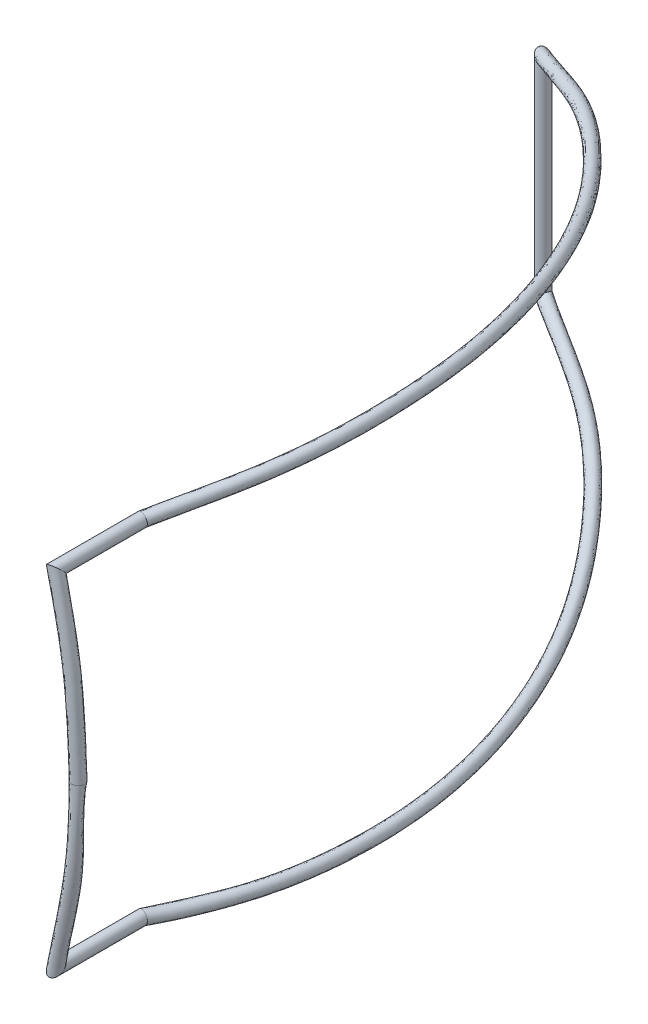
ISO-10303-21;
HEADER;
FILE_DESCRIPTION(('STEP AP214'),'2;1');
FILE_NAME('part.step','',(''),(''),'','','');
FILE_SCHEMA(('AUTOMOTIVE_DESIGN { 1 0 10303 214 1 1 1 1 }'));
ENDSEC;
DATA;
#1=APPLICATION_CONTEXT('core data for automotive mechanical design processes');
#2=APPLICATION_PROTOCOL_DEFINITION('international standard','automotive_design',2000,#1);
#3=PRODUCT_CONTEXT('',#1,'mechanical');
#4=PRODUCT('Part','Part','',(#3));
#5=PRODUCT_RELATED_PRODUCT_CATEGORY('part','',(#4));
#6=PRODUCT_DEFINITION_FORMATION('','',#4);
#7=PRODUCT_DEFINITION_CONTEXT('part definition',#1,'design');
#8=PRODUCT_DEFINITION('design','',#6,#7);
#9=PRODUCT_DEFINITION_SHAPE('','',#8);
#10=(LENGTH_UNIT() NAMED_UNIT(*) SI_UNIT(.MILLI.,.METRE.));
#11=(NAMED_UNIT(*) PLANE_ANGLE_UNIT() SI_UNIT($,.RADIAN.));
#12=(NAMED_UNIT(*) SI_UNIT($,.STERADIAN.) SOLID_ANGLE_UNIT());
#13=UNCERTAINTY_MEASURE_WITH_UNIT(LENGTH_MEASURE(1.E-05),#10,'distance_accuracy_value','');
#14=(GEOMETRIC_REPRESENTATION_CONTEXT(3) GLOBAL_UNCERTAINTY_ASSIGNED_CONTEXT((#13)) GLOBAL_UNIT_ASSIGNED_CONTEXT((#10,
#11,#12)) REPRESENTATION_CONTEXT('',''));
#15=CARTESIAN_POINT('',(0.,0.,0.));
#16=DIRECTION('',(0.,0.,1.));
#17=DIRECTION('',(1.,0.,0.));
#18=AXIS2_PLACEMENT_3D('',#15,#16,#17);
#19=CARTESIAN_POINT('',(1840.,0.,16.85));
#20=CARTESIAN_POINT('',(1836.8396931025,88.9620389803422,16.8500000000001));
#21=CARTESIAN_POINT('',(1831.18867065611,248.037247641803,16.8500000000004));
#22=CARTESIAN_POINT('',(1793.69727131029,406.964526359535,16.8499999999992));
#23=CARTESIAN_POINT('',(1777.1727552274,477.012495200543,16.8499999999987));
#24=CARTESIAN_POINT('',(1873.7,0.,16.85));
#25=CARTESIAN_POINT('',(1870.48241577035,90.5585240920456,16.8500000000001));
#26=CARTESIAN_POINT('',(1864.72897431842,252.488447024672,16.8500000000004));
#27=CARTESIAN_POINT('',(1826.60337396209,414.18275217626,16.8499999999992));
#28=CARTESIAN_POINT('',(1809.79933070814,485.450301337177,16.8499999999987));
#29=CARTESIAN_POINT('',(1873.7,0.,-16.85));
#30=CARTESIAN_POINT('',(1870.5591471221,86.8884708383124,-16.8500000000001));
#31=CARTESIAN_POINT('',(1864.94291088636,242.255881334985,-16.8500000000004));
#32=CARTESIAN_POINT('',(1832.52533890872,388.406938587006,-16.8499999999992));
#33=CARTESIAN_POINT('',(1818.23713684478,452.823725856438,-16.8499999999987));
#34=CARTESIAN_POINT('',(1840.,0.,-16.85));
#35=CARTESIAN_POINT('',(1836.91642445425,85.291985726609,-16.8500000000001));
#36=CARTESIAN_POINT('',(1831.40260722405,237.804681952116,-16.8500000000004));
#37=CARTESIAN_POINT('',(1799.61923625692,381.188712770281,-16.8499999999992));
#38=CARTESIAN_POINT('',(1785.61056136403,444.385919719803,-16.8499999999987));
#39=CARTESIAN_POINT('',(1806.3,0.,-16.85));
#40=CARTESIAN_POINT('',(1803.2737017864,83.6955006149055,-16.8500000000001));
#41=CARTESIAN_POINT('',(1797.86230356175,233.353482569248,-16.8500000000004));
#42=CARTESIAN_POINT('',(1766.71313360513,373.970486953556,-16.8499999999992));
#43=CARTESIAN_POINT('',(1752.98398588329,435.948113583169,-16.8499999999987));
#44=CARTESIAN_POINT('',(1806.3,0.,16.85));
#45=CARTESIAN_POINT('',(1803.19697043465,87.3655538686387,16.8500000000001));
#46=CARTESIAN_POINT('',(1797.6483669938,243.586048258934,16.8500000000004));
#47=CARTESIAN_POINT('',(1760.7911686585,399.746300542811,16.8499999999992));
#48=CARTESIAN_POINT('',(1744.54617974666,468.574689063908,16.8499999999987));
#49=CARTESIAN_POINT('',(1840.,0.,16.85));
#50=CARTESIAN_POINT('',(1836.8396931025,88.9620389803422,16.8500000000001));
#51=CARTESIAN_POINT('',(1831.18867065611,248.037247641803,16.8500000000004));
#52=CARTESIAN_POINT('',(1793.69727131029,406.964526359535,16.8499999999992));
#53=CARTESIAN_POINT('',(1777.1727552274,477.012495200543,16.8499999999987));
#54=(BOUNDED_SURFACE() B_SPLINE_SURFACE(3,3,((#19,#20,#21,#22,#23),(#24,#25,#26,#27,#28),(#29,
#30,#31,#32,#33),(#34,#35,#36,#37,#38),(#39,#40,#41,#42,#43),(#44,#45,#46,#47,#48),(#49,#50,#51,
#52,#53)),.UNSPECIFIED.,.T.,.F.,.F.) B_SPLINE_SURFACE_WITH_KNOTS((4,3,4),(4,1,4),(0.,0.5,1.),
(0.,0.559245150321749,1.),
.UNSPECIFIED.) GEOMETRIC_REPRESENTATION_ITEM() RATIONAL_B_SPLINE_SURFACE(((1.,1.,1.,1.,1.),
(0.333333333333333,0.333333333333333,0.333333333333333,0.333333333333333,0.333333333333333),
(0.333333333333333,0.333333333333333,0.333333333333333,0.333333333333333,0.333333333333333),(1.,
1.,1.,1.,1.),(0.333333333333333,0.333333333333333,0.333333333333333,0.333333333333333,
0.333333333333333),(0.333333333333333,0.333333333333333,0.333333333333333,0.333333333333333,
0.333333333333333),(1.,1.,1.,1.,1.))) REPRESENTATION_ITEM('') SURFACE());
#55=CARTESIAN_POINT('',(1840.,0.,0.));
#56=DIRECTION('',(0.,-1.,0.));
#57=DIRECTION('',(0.,0.,-1.));
#58=AXIS2_PLACEMENT_3D('',#55,#56,#57);
#59=CIRCLE('',#58,16.85);
#60=CARTESIAN_POINT('',(1840.,0.,-16.85));
#61=VERTEX_POINT('',#60);
#62=EDGE_CURVE('E220',#61,#61,#59,.T.);
#63=CARTESIAN_POINT('',(1777.1727552274,477.012495200543,16.8499999999982));
#64=CARTESIAN_POINT('',(1744.54617974666,468.574689063908,16.8499999999982));
#65=CARTESIAN_POINT('',(1752.98398588329,435.948113583169,-16.849999999999));
#66=CARTESIAN_POINT('',(1785.61056136403,444.385919719803,-16.849999999999));
#67=CARTESIAN_POINT('',(1818.23713684478,452.823725856438,-16.8499999999991));
#68=CARTESIAN_POINT('',(1809.79933070814,485.450301337177,16.8499999999983));
#69=CARTESIAN_POINT('',(1777.1727552274,477.012495200543,16.8499999999982));
#70=(BOUNDED_CURVE() B_SPLINE_CURVE(3,(#63,#64,#65,#66,#67,#68,#69),.UNSPECIFIED.,.T.,
.F.) B_SPLINE_CURVE_WITH_KNOTS((4,3,4),(0.,0.5,1.),
.UNSPECIFIED.) CURVE() GEOMETRIC_REPRESENTATION_ITEM() RATIONAL_B_SPLINE_CURVE((1.,
0.333333333333333,0.333333333333333,1.,0.333333333333333,0.333333333333333,1.)) REPRESENTATION_ITEM(''));
#71=CARTESIAN_POINT('',(1777.1727552274,477.012495200543,16.8499999999982));
#72=VERTEX_POINT('',#71);
#73=EDGE_CURVE('E179',#72,#72,#70,.T.);
#74=ORIENTED_EDGE('',*,*,#62,.F.);
#75=EDGE_LOOP('',(#74));
#76=FACE_BOUND('',#75,.T.);
#77=ORIENTED_EDGE('',*,*,#73,.T.);
#78=EDGE_LOOP('',(#77));
#79=FACE_BOUND('',#78,.T.);
#80=ADVANCED_FACE('F169',(#76,#79),#54,.T.);
#81=CARTESIAN_POINT('',(1777.1727552274,477.012495200543,16.8499999999982));
#82=CARTESIAN_POINT('',(1777.1727552274,477.012495200543,-230.));
#83=CARTESIAN_POINT('',(1744.54617974666,468.574689063908,16.8499999999982));
#84=CARTESIAN_POINT('',(1744.54617974666,468.574689063908,-236.584026233853));
#85=CARTESIAN_POINT('',(1752.98398588329,435.948113583169,-16.849999999999));
#86=CARTESIAN_POINT('',(1752.98398588329,435.948113583169,-236.584026233853));
#87=CARTESIAN_POINT('',(1785.61056136403,444.385919719803,-16.849999999999));
#88=CARTESIAN_POINT('',(1785.61056136403,444.385919719803,-230.));
#89=CARTESIAN_POINT('',(1818.23713684478,452.823725856438,-16.8499999999991));
#90=CARTESIAN_POINT('',(1818.23713684478,452.823725856438,-223.415973766147));
#91=CARTESIAN_POINT('',(1809.79933070814,485.450301337177,16.8499999999983));
#92=CARTESIAN_POINT('',(1809.79933070814,485.450301337177,-223.415973766147));
#93=CARTESIAN_POINT('',(1777.1727552274,477.012495200543,16.8499999999982));
#94=CARTESIAN_POINT('',(1777.1727552274,477.012495200543,-230.));
#95=(BOUNDED_SURFACE() B_SPLINE_SURFACE(3,1,((#81,#82),(#83,#84),(#85,#86),(#87,#88),(#89,#90),
(#91,#92),(#93,#94)),.UNSPECIFIED.,.T.,.F.,.F.) B_SPLINE_SURFACE_WITH_KNOTS((4,3,4),(2,2),(0.,
0.5,1.),(0.,1.),.UNSPECIFIED.) GEOMETRIC_REPRESENTATION_ITEM() RATIONAL_B_SPLINE_SURFACE(((1.,
1.),(0.333333333333333,0.333333333333333),(0.333333333333333,0.333333333333333),(1.,1.),
(0.333333333333333,0.333333333333333),(0.333333333333333,0.333333333333333),(1.,1.))) REPRESENTATION_ITEM('') SURFACE());
#96=CARTESIAN_POINT('',(1777.1727552274,477.012495200543,-230.));
#97=CARTESIAN_POINT('',(1744.54617974666,468.574689063908,-236.584026233853));
#98=CARTESIAN_POINT('',(1752.98398588329,435.948113583169,-236.584026233853));
#99=CARTESIAN_POINT('',(1785.61056136403,444.385919719803,-230.));
#100=CARTESIAN_POINT('',(1818.23713684478,452.823725856438,-223.415973766147));
#101=CARTESIAN_POINT('',(1809.79933070814,485.450301337177,-223.415973766147));
#102=CARTESIAN_POINT('',(1777.1727552274,477.012495200543,-230.));
#103=(BOUNDED_CURVE() B_SPLINE_CURVE(3,(#96,#97,#98,#99,#100,#101,#102),.UNSPECIFIED.,.T.,
.F.) B_SPLINE_CURVE_WITH_KNOTS((4,3,4),(0.,0.5,1.),
.UNSPECIFIED.) CURVE() GEOMETRIC_REPRESENTATION_ITEM() RATIONAL_B_SPLINE_CURVE((1.,
0.333333333333333,0.333333333333333,1.,0.333333333333333,0.333333333333333,1.)) REPRESENTATION_ITEM(''));
#104=CARTESIAN_POINT('',(1777.1727552274,477.012495200543,-230.));
#105=VERTEX_POINT('',#104);
#106=EDGE_CURVE('E11',#105,#105,#103,.F.);
#107=ORIENTED_EDGE('',*,*,#73,.F.);
#108=EDGE_LOOP('',(#107));
#109=FACE_BOUND('',#108,.T.);
#110=ORIENTED_EDGE('',*,*,#106,.F.);
#111=EDGE_LOOP('',(#110));
#112=FACE_BOUND('',#111,.T.);
#113=ADVANCED_FACE('F230',(#109,#112),#95,.F.);
#114=CARTESIAN_POINT('',(1777.1727552274,477.012495200543,-230.));
#115=CARTESIAN_POINT('',(1802.64133835024,483.599118644739,-320.242530844923));
#116=CARTESIAN_POINT('',(1869.22469923484,500.818746595011,-504.951893264891));
#117=CARTESIAN_POINT('',(1884.24578707965,504.703464047833,-807.69506243528));
#118=CARTESIAN_POINT('',(1839.90053464785,493.235001986269,-1117.50122357849));
#119=CARTESIAN_POINT('',(1732.76934268335,465.528991911242,-1392.33007822084));
#120=CARTESIAN_POINT('',(1587.44755758994,427.946222896098,-1618.7491031282));
#121=CARTESIAN_POINT('',(1423.91973688211,385.655052929658,-1793.04888951959));
#122=CARTESIAN_POINT('',(1243.45165175071,338.982832699642,-1935.04833855551));
#123=CARTESIAN_POINT('',(1106.46035404363,303.554474208858,-1995.57212333256));
#124=CARTESIAN_POINT('',(1043.37030204873,287.238277365049,-2029.23179911131));
#125=CARTESIAN_POINT('',(1809.79933070814,485.450301337177,-223.415973766147));
#126=CARTESIAN_POINT('',(1835.26791383098,492.036924781374,-313.65850461107));
#127=CARTESIAN_POINT('',(1902.80069378307,509.50208919742,-506.139102517305));
#128=CARTESIAN_POINT('',(1916.79676669647,513.121719764753,-814.487696982543));
#129=CARTESIAN_POINT('',(1870.37342125734,501.115826309566,-1131.56982602809));
#130=CARTESIAN_POINT('',(1759.55557297252,472.456382082629,-1412.28382636626));
#131=CARTESIAN_POINT('',(1611.03883740037,434.047342692537,-1643.08610187998));
#132=CARTESIAN_POINT('',(1440.91443219699,390.050179978855,-1821.35533111465));
#133=CARTESIAN_POINT('',(1264.97761800727,344.54982609384,-1963.92338476348));
#134=CARTESIAN_POINT('',(1104.10222446452,302.944620433509,-2030.3712850037));
#135=CARTESIAN_POINT('',(1053.62056395293,289.889175337728,-2061.33510316082));
#136=CARTESIAN_POINT('',(1818.23713684478,452.823725856438,-223.415973766147));
#137=CARTESIAN_POINT('',(1843.70571996762,459.410349300634,-313.65850461107));
#138=CARTESIAN_POINT('',(1910.36499909114,476.649611042465,-502.798940385682));
#139=CARTESIAN_POINT('',(1925.28994912527,480.509465566923,-808.791327311698));
#140=CARTESIAN_POINT('',(1880.83283475814,469.012074041864,-1122.93008369987));
#141=CARTESIAN_POINT('',(1772.86155621825,441.088802806059,-1402.11499068706));
#142=CARTESIAN_POINT('',(1628.29654721672,403.701749395696,-1631.1255496292));
#143=CARTESIAN_POINT('',(1462.84057463824,360.911925450196,-1809.04396925961));
#144=CARTESIAN_POINT('',(1290.60650754437,316.369167074587,-1951.60591622528));
#145=CARTESIAN_POINT('',(1136.20552851402,276.438358855576,-2020.12102309951));
#146=CARTESIAN_POINT('',(1085.72386800244,263.382913759795,-2051.08484125663));
#147=CARTESIAN_POINT('',(1785.61056136404,444.385919719803,-230.));
#148=CARTESIAN_POINT('',(1811.07914448688,450.972543164,-320.242530844923));
#149=CARTESIAN_POINT('',(1876.79071715641,467.966711352022,-501.611364951575));
#150=CARTESIAN_POINT('',(1892.73245234638,472.089524397294,-802.000086228545));
#151=CARTESIAN_POINT('',(1850.38535598113,461.137820630825,-1108.85604868586));
#152=CARTESIAN_POINT('',(1745.98805733121,434.138843440704,-1382.1799018381));
#153=CARTESIAN_POINT('',(1604.94974633976,397.66385615046,-1606.73627772291));
#154=CARTESIAN_POINT('',(1444.96524100686,356.289049846893,-1780.92582095482));
#155=CARTESIAN_POINT('',(1272.1642998631,311.599687873868,-1922.071517548));
#156=CARTESIAN_POINT('',(1132.25946235148,275.417836756911,-1986.66979023918));
#157=CARTESIAN_POINT('',(1075.47360609824,260.732015787116,-2018.98153720712));
#158=CARTESIAN_POINT('',(1752.98398588329,435.948113583169,-236.584026233854));
#159=CARTESIAN_POINT('',(1778.45256900613,442.534737027365,-326.826557078776));
#160=CARTESIAN_POINT('',(1843.21643522168,459.283811661577,-500.423789517467));
#161=CARTESIAN_POINT('',(1860.1749555675,463.669583227664,-795.208845145391));
#162=CARTESIAN_POINT('',(1819.93787720411,453.263567219786,-1094.78201367185));
#163=CARTESIAN_POINT('',(1719.11455844418,427.188884075349,-1362.24481298915));
#164=CARTESIAN_POINT('',(1581.60294546281,391.625962905223,-1582.34700581662));
#165=CARTESIAN_POINT('',(1427.08990737548,351.666174243589,-1752.80767265003));
#166=CARTESIAN_POINT('',(1253.72209218183,306.830208673148,-1892.53711887073));
#167=CARTESIAN_POINT('',(1128.31339618894,274.397314658245,-1953.21855737885));
#168=CARTESIAN_POINT('',(1065.22334419404,258.081117814436,-1986.87823315761));
#169=CARTESIAN_POINT('',(1744.54617974666,468.574689063908,-236.584026233854));
#170=CARTESIAN_POINT('',(1770.0147628695,475.161312508105,-326.826557078776));
#171=CARTESIAN_POINT('',(1835.64870468662,492.135403992602,-503.764684012476));
#172=CARTESIAN_POINT('',(1851.69480746283,496.285208330912,-800.902427888018));
#173=CARTESIAN_POINT('',(1809.42764803836,485.354177662972,-1103.43262112889));
#174=CARTESIAN_POINT('',(1705.98311239417,458.601601739854,-1372.37633007541));
#175=CARTESIAN_POINT('',(1563.8562777795,421.845103099659,-1594.41210437642));
#176=CARTESIAN_POINT('',(1406.92504156724,381.259925880461,-1764.74244792452));
#177=CARTESIAN_POINT('',(1221.92568549415,333.415839305443,-1906.17329234754));
#178=CARTESIAN_POINT('',(1108.81848362275,304.164327984207,-1960.77296166142));
#179=CARTESIAN_POINT('',(1033.12004014453,284.587379392369,-1997.1284950618));
#180=CARTESIAN_POINT('',(1777.1727552274,477.012495200543,-230.));
#181=CARTESIAN_POINT('',(1802.64133835024,483.599118644739,-320.242530844923));
#182=CARTESIAN_POINT('',(1869.22469923484,500.818746595011,-504.951893264891));
#183=CARTESIAN_POINT('',(1884.24578707965,504.703464047833,-807.69506243528));
#184=CARTESIAN_POINT('',(1839.90053464785,493.235001986269,-1117.50122357849));
#185=CARTESIAN_POINT('',(1732.76934268335,465.528991911242,-1392.33007822084));
#186=CARTESIAN_POINT('',(1587.44755758994,427.946222896098,-1618.7491031282));
#187=CARTESIAN_POINT('',(1423.91973688211,385.655052929658,-1793.04888951959));
#188=CARTESIAN_POINT('',(1243.45165175071,338.982832699642,-1935.04833855551));
#189=CARTESIAN_POINT('',(1106.46035404363,303.554474208858,-1995.57212333256));
#190=CARTESIAN_POINT('',(1043.37030204873,287.238277365049,-2029.23179911131));
#191=(BOUNDED_SURFACE() B_SPLINE_SURFACE(3,3,((#114,#115,#116,#117,#118,#119,#120,#121,#122,
#123,#124),(#125,#126,#127,#128,#129,#130,#131,#132,#133,#134,#135),(#136,#137,#138,#139,#140,
#141,#142,#143,#144,#145,#146),(#147,#148,#149,#150,#151,#152,#153,#154,#155,#156,#157),(#158,
#159,#160,#161,#162,#163,#164,#165,#166,#167,#168),(#169,#170,#171,#172,#173,#174,#175,#176,
#177,#178,#179),(#180,#181,#182,#183,#184,#185,#186,#187,#188,#189,#190)),.UNSPECIFIED.,.T.,.F.,
.F.) B_SPLINE_SURFACE_WITH_KNOTS((4,3,4),(4,1,1,1,1,1,1,1,4),(0.,0.5,1.),(0.,0.131068555277093,
0.270506186592381,0.415604271662539,0.562879130524955,0.677757918686354,0.789857505809436,
0.897660312965874,1.),
.UNSPECIFIED.) GEOMETRIC_REPRESENTATION_ITEM() RATIONAL_B_SPLINE_SURFACE(((1.,1.,1.,1.,1.,1.,1.,
1.,1.,1.,1.),(0.333333333333333,0.333333333333333,0.333333333333333,0.333333333333333,
0.333333333333333,0.333333333333333,0.333333333333333,0.333333333333333,0.333333333333333,
0.333333333333333,0.333333333333333),(0.333333333333333,0.333333333333333,0.333333333333333,
0.333333333333333,0.333333333333333,0.333333333333333,0.333333333333333,0.333333333333333,
0.333333333333333,0.333333333333333,0.333333333333333),(1.,1.,1.,1.,1.,1.,1.,1.,1.,1.,1.),
(0.333333333333333,0.333333333333333,0.333333333333333,0.333333333333333,0.333333333333333,
0.333333333333333,0.333333333333333,0.333333333333333,0.333333333333333,0.333333333333333,
0.333333333333333),(0.333333333333333,0.333333333333333,0.333333333333333,0.333333333333333,
0.333333333333333,0.333333333333333,0.333333333333333,0.333333333333333,0.333333333333333,
0.333333333333333,0.333333333333333),(1.,1.,1.,1.,1.,1.,1.,1.,1.,1.,1.))) REPRESENTATION_ITEM('') SURFACE());
#192=CARTESIAN_POINT('',(1043.37030204873,287.238277365047,-2029.23179911131));
#193=CARTESIAN_POINT('',(1033.12004014453,284.587379392367,-1997.1284950618));
#194=CARTESIAN_POINT('',(1065.22334419404,258.081117814434,-1986.87823315761));
#195=CARTESIAN_POINT('',(1075.47360609824,260.732015787114,-2018.98153720712));
#196=CARTESIAN_POINT('',(1085.72386800244,263.382913759794,-2051.08484125663));
#197=CARTESIAN_POINT('',(1053.62056395293,289.889175337726,-2061.33510316082));
#198=CARTESIAN_POINT('',(1043.37030204873,287.238277365047,-2029.23179911131));
#199=(BOUNDED_CURVE() B_SPLINE_CURVE(3,(#192,#193,#194,#195,#196,#197,#198),.UNSPECIFIED.,.T.,
.F.) B_SPLINE_CURVE_WITH_KNOTS((4,3,4),(0.,0.5,1.),
.UNSPECIFIED.) CURVE() GEOMETRIC_REPRESENTATION_ITEM() RATIONAL_B_SPLINE_CURVE((1.,
0.333333333333333,0.333333333333333,1.,0.333333333333333,0.333333333333333,1.)) REPRESENTATION_ITEM(''));
#200=CARTESIAN_POINT('',(1043.37030204873,287.238277365047,-2029.23179911131));
#201=VERTEX_POINT('',#200);
#202=EDGE_CURVE('E187',#201,#201,#199,.T.);
#203=ORIENTED_EDGE('',*,*,#106,.T.);
#204=EDGE_LOOP('',(#203));
#205=FACE_BOUND('',#204,.T.);
#206=ORIENTED_EDGE('',*,*,#202,.T.);
#207=EDGE_LOOP('',(#206));
#208=FACE_BOUND('',#207,.T.);
#209=ADVANCED_FACE('F234',(#205,#208),#191,.T.);
#210=CARTESIAN_POINT('',(1043.37030204873,287.238277365047,-2029.23179911131));
#211=CARTESIAN_POINT('',(1043.37030204873,-287.238277365049,-2029.23179911131));
#212=CARTESIAN_POINT('',(1033.12004014453,284.587379392367,-1997.1284950618));
#213=CARTESIAN_POINT('',(1033.12004014453,-284.58737939237,-1997.1284950618));
#214=CARTESIAN_POINT('',(1065.22334419404,258.081117814434,-1986.87823315761));
#215=CARTESIAN_POINT('',(1065.22334419404,-258.081117814437,-1986.8782331576));
#216=CARTESIAN_POINT('',(1075.47360609824,260.732015787114,-2018.98153720712));
#217=CARTESIAN_POINT('',(1075.47360609824,-260.732015787116,-2018.98153720711));
#218=CARTESIAN_POINT('',(1085.72386800244,263.382913759794,-2051.08484125663));
#219=CARTESIAN_POINT('',(1085.72386800244,-263.382913759796,-2051.08484125662));
#220=CARTESIAN_POINT('',(1053.62056395293,289.889175337726,-2061.33510316082));
#221=CARTESIAN_POINT('',(1053.62056395293,-289.889175337729,-2061.33510316082));
#222=CARTESIAN_POINT('',(1043.37030204873,287.238277365047,-2029.23179911131));
#223=CARTESIAN_POINT('',(1043.37030204873,-287.238277365049,-2029.23179911131));
#224=(BOUNDED_SURFACE() B_SPLINE_SURFACE(3,1,((#210,#211),(#212,#213),(#214,#215),(#216,#217),
(#218,#219),(#220,#221),(#222,#223)),.UNSPECIFIED.,.T.,.F.,.F.) B_SPLINE_SURFACE_WITH_KNOTS((4,
3,4),(2,2),(0.,0.5,1.),(0.,1.),
.UNSPECIFIED.) GEOMETRIC_REPRESENTATION_ITEM() RATIONAL_B_SPLINE_SURFACE(((1.,1.),
(0.333333333333333,0.333333333333333),(0.333333333333333,0.333333333333333),(1.,1.),
(0.333333333333333,0.333333333333333),(0.333333333333333,0.333333333333333),(1.,1.))) REPRESENTATION_ITEM('') SURFACE());
#225=CARTESIAN_POINT('',(1043.37030204873,-287.238277365049,-2029.23179911131));
#226=CARTESIAN_POINT('',(1033.12004014453,-284.58737939237,-1997.1284950618));
#227=CARTESIAN_POINT('',(1065.22334419404,-258.081117814437,-1986.8782331576));
#228=CARTESIAN_POINT('',(1075.47360609824,-260.732015787116,-2018.98153720711));
#229=CARTESIAN_POINT('',(1085.72386800244,-263.382913759796,-2051.08484125662));
#230=CARTESIAN_POINT('',(1053.62056395293,-289.889175337729,-2061.33510316082));
#231=CARTESIAN_POINT('',(1043.37030204873,-287.238277365049,-2029.23179911131));
#232=(BOUNDED_CURVE() B_SPLINE_CURVE(3,(#225,#226,#227,#228,#229,#230,#231),.UNSPECIFIED.,.T.,
.F.) B_SPLINE_CURVE_WITH_KNOTS((4,3,4),(0.,0.5,1.),
.UNSPECIFIED.) CURVE() GEOMETRIC_REPRESENTATION_ITEM() RATIONAL_B_SPLINE_CURVE((1.,
0.333333333333333,0.333333333333333,1.,0.333333333333333,0.333333333333333,1.)) REPRESENTATION_ITEM(''));
#233=CARTESIAN_POINT('',(1043.37030204873,-287.238277365049,-2029.23179911131));
#234=VERTEX_POINT('',#233);
#235=EDGE_CURVE('E183',#234,#234,#232,.F.);
#236=ORIENTED_EDGE('',*,*,#202,.F.);
#237=EDGE_LOOP('',(#236));
#238=FACE_BOUND('',#237,.T.);
#239=ORIENTED_EDGE('',*,*,#235,.F.);
#240=EDGE_LOOP('',(#239));
#241=FACE_BOUND('',#240,.T.);
#242=ADVANCED_FACE('F239',(#238,#241),#224,.F.);
#243=CARTESIAN_POINT('',(1043.37030204873,-287.238277365049,-2029.23179911131));
#244=CARTESIAN_POINT('',(1123.26501158104,-307.90045414711,-1984.22450473193));
#245=CARTESIAN_POINT('',(1299.07601265646,-353.368270548426,-1905.14598856341));
#246=CARTESIAN_POINT('',(1519.07680381664,-410.264343714656,-1703.86164674041));
#247=CARTESIAN_POINT('',(1702.74802290677,-457.764950711446,-1454.39656442399));
#248=CARTESIAN_POINT('',(1818.02932793637,-487.578723339597,-1182.98757127613));
#249=CARTESIAN_POINT('',(1873.03056802709,-501.803011188436,-917.4372193597));
#250=CARTESIAN_POINT('',(1879.43220677865,-503.458587538284,-675.077818252223));
#251=CARTESIAN_POINT('',(1851.16069203214,-496.14707668846,-442.94545001125));
#252=CARTESIAN_POINT('',(1798.57526466705,-482.547560490978,-299.934557663665));
#253=CARTESIAN_POINT('',(1777.1727552274,-477.012495200542,-230.));
#254=CARTESIAN_POINT('',(1053.62056395293,-289.889175337729,-2061.33510316082));
#255=CARTESIAN_POINT('',(1132.26120135728,-310.227027015449,-2013.95278664359));
#256=CARTESIAN_POINT('',(1316.68747228992,-357.920019532933,-1935.78257752551));
#257=CARTESIAN_POINT('',(1540.12780224443,-415.719475291534,-1729.54883579081));
#258=CARTESIAN_POINT('',(1729.21792329394,-464.567758646504,-1475.34301728829));
#259=CARTESIAN_POINT('',(1847.74898902784,-495.411646952887,-1197.7487705054));
#260=CARTESIAN_POINT('',(1905.15763087625,-509.700171703671,-927.278074997533));
#261=CARTESIAN_POINT('',(1911.79274841348,-513.309459671587,-676.852793754656));
#262=CARTESIAN_POINT('',(1886.74230810389,-500.161128192563,-448.693527663193));
#263=CARTESIAN_POINT('',(1826.74441985203,-500.436652286609,-280.235204143671));
#264=CARTESIAN_POINT('',(1809.79933070814,-485.450301337177,-223.415973766147));
#265=CARTESIAN_POINT('',(1085.72386800244,-263.382913759796,-2051.08484125662));
#266=CARTESIAN_POINT('',(1164.36450540679,-283.720765437516,-2003.70252473939));
#267=CARTESIAN_POINT('',(1341.67028851185,-329.572274593598,-1922.35355497323));
#268=CARTESIAN_POINT('',(1560.88065901668,-386.277788457398,-1715.93302382006));
#269=CARTESIAN_POINT('',(1744.65631090515,-433.751656635805,-1462.18133380792));
#270=CARTESIAN_POINT('',(1859.66388820289,-463.684308874325,-1185.98295236834));
#271=CARTESIAN_POINT('',(1914.38656274947,-477.27819524985,-918.556919704381));
#272=CARTESIAN_POINT('',(1919.80883332198,-480.573819665554,-671.16847357423));
#273=CARTESIAN_POINT('',(1894.22433831664,-467.287372251202,-445.416680825746));
#274=CARTESIAN_POINT('',(1835.18222598867,-467.810076805869,-280.235204143671));
#275=CARTESIAN_POINT('',(1818.23713684478,-452.823725856437,-223.415973766147));
#276=CARTESIAN_POINT('',(1075.47360609824,-260.732015787116,-2018.98153720712));
#277=CARTESIAN_POINT('',(1154.74127956657,-281.232030017007,-1972.78673175881));
#278=CARTESIAN_POINT('',(1324.36931918605,-325.099381780983,-1892.30562308126));
#279=CARTESIAN_POINT('',(1539.73831701444,-380.80452043355,-1690.07042573545));
#280=CARTESIAN_POINT('',(1718.22026253886,-426.936216548008,-1441.30841762366));
#281=CARTESIAN_POINT('',(1829.9082633624,-455.915532730106,-1171.12127150678));
#282=CARTESIAN_POINT('',(1882.34716659135,-469.197975446848,-908.972765924589));
#283=CARTESIAN_POINT('',(1887.13653643586,-471.383255655879,-668.476520544401));
#284=CARTESIAN_POINT('',(1859.73318816752,-460.961344363908,-442.877060064707));
#285=CARTESIAN_POINT('',(1804.7843606558,-454.646627839736,-293.376894020595));
#286=CARTESIAN_POINT('',(1785.61056136403,-444.385919719802,-230.));
#287=CARTESIAN_POINT('',(1065.22334419404,-258.081117814437,-1986.8782331576));
#288=CARTESIAN_POINT('',(1145.11805372635,-278.743294596498,-1941.87093877822));
#289=CARTESIAN_POINT('',(1307.06834986025,-320.626488968369,-1862.2576911893));
#290=CARTESIAN_POINT('',(1518.59597501219,-375.331252409702,-1664.20782765083));
#291=CARTESIAN_POINT('',(1691.78421417258,-420.120776460211,-1420.43550143941));
#292=CARTESIAN_POINT('',(1800.15263852191,-448.146756585889,-1156.25959064522));
#293=CARTESIAN_POINT('',(1850.30777043323,-461.117755643847,-899.388612144797));
#294=CARTESIAN_POINT('',(1854.46423954973,-462.192691646206,-665.784567514572));
#295=CARTESIAN_POINT('',(1825.24203801841,-454.635316476614,-440.337439303669));
#296=CARTESIAN_POINT('',(1774.38649532294,-441.483178873604,-306.518583897518));
#297=CARTESIAN_POINT('',(1752.98398588329,-435.948113583168,-236.584026233854));
#298=CARTESIAN_POINT('',(1033.12004014453,-284.58737939237,-1997.1284950618));
#299=CARTESIAN_POINT('',(1114.2688218048,-305.573881278772,-1954.49622282027));
#300=CARTESIAN_POINT('',(1281.464553023,-348.816521563919,-1874.50939960132));
#301=CARTESIAN_POINT('',(1498.02580538884,-404.809212137778,-1678.17445769001));
#302=CARTESIAN_POINT('',(1676.27812251959,-450.962142776388,-1433.45011155969));
#303=CARTESIAN_POINT('',(1788.3096668449,-479.745799726306,-1168.22637204685));
#304=CARTESIAN_POINT('',(1840.90350517792,-493.905850673201,-907.596363721867));
#305=CARTESIAN_POINT('',(1847.07166514381,-493.607715404981,-673.302842749791));
#306=CARTESIAN_POINT('',(1815.57907596038,-492.133025184357,-437.197372359308));
#307=CARTESIAN_POINT('',(1770.40610948206,-464.658468695347,-319.633911183658));
#308=CARTESIAN_POINT('',(1744.54617974666,-468.574689063908,-236.584026233853));
#309=CARTESIAN_POINT('',(1043.37030204873,-287.238277365049,-2029.23179911131));
#310=CARTESIAN_POINT('',(1123.26501158104,-307.90045414711,-1984.22450473193));
#311=CARTESIAN_POINT('',(1299.07601265646,-353.368270548426,-1905.14598856341));
#312=CARTESIAN_POINT('',(1519.07680381664,-410.264343714656,-1703.86164674041));
#313=CARTESIAN_POINT('',(1702.74802290677,-457.764950711446,-1454.39656442399));
#314=CARTESIAN_POINT('',(1818.02932793637,-487.578723339597,-1182.98757127613));
#315=CARTESIAN_POINT('',(1873.03056802709,-501.803011188436,-917.4372193597));
#316=CARTESIAN_POINT('',(1879.43220677865,-503.458587538284,-675.077818252223));
#317=CARTESIAN_POINT('',(1851.16069203214,-496.14707668846,-442.94545001125));
#318=CARTESIAN_POINT('',(1798.57526466705,-482.547560490978,-299.934557663665));
#319=CARTESIAN_POINT('',(1777.1727552274,-477.012495200542,-230.));
#320=(BOUNDED_SURFACE() B_SPLINE_SURFACE(3,3,((#243,#244,#245,#246,#247,#248,#249,#250,#251,
#252,#253),(#254,#255,#256,#257,#258,#259,#260,#261,#262,#263,#264),(#265,#266,#267,#268,#269,
#270,#271,#272,#273,#274,#275),(#276,#277,#278,#279,#280,#281,#282,#283,#284,#285,#286),(#287,
#288,#289,#290,#291,#292,#293,#294,#295,#296,#297),(#298,#299,#300,#301,#302,#303,#304,#305,
#306,#307,#308),(#309,#310,#311,#312,#313,#314,#315,#316,#317,#318,#319)),.UNSPECIFIED.,.T.,.F.,
.F.) B_SPLINE_SURFACE_WITH_KNOTS((4,3,4),(4,1,1,1,1,1,1,1,4),(0.,0.5,1.),(0.,0.131117592017178,
0.270587999347008,0.415704819807108,0.562985590271123,0.677858050946448,0.789938758241193,
0.897708932696292,1.),
.UNSPECIFIED.) GEOMETRIC_REPRESENTATION_ITEM() RATIONAL_B_SPLINE_SURFACE(((1.,1.,1.,1.,1.,1.,1.,
1.,1.,1.,1.),(0.333333333333333,0.333333333333333,0.333333333333333,0.333333333333334,
0.333333333333333,0.333333333333333,0.333333333333334,0.333333333333333,0.333333333333334,
0.333333333333333,0.333333333333333),(0.333333333333333,0.333333333333333,0.333333333333333,
0.333333333333334,0.333333333333333,0.333333333333333,0.333333333333334,0.333333333333333,
0.333333333333334,0.333333333333333,0.333333333333333),(1.,1.,1.,1.,1.,1.,1.,1.,1.,1.,1.),
(0.333333333333333,0.333333333333333,0.333333333333333,0.333333333333334,0.333333333333333,
0.333333333333333,0.333333333333334,0.333333333333333,0.333333333333334,0.333333333333333,
0.333333333333333),(0.333333333333333,0.333333333333333,0.333333333333333,0.333333333333334,
0.333333333333333,0.333333333333333,0.333333333333334,0.333333333333333,0.333333333333334,
0.333333333333333,0.333333333333333),(1.,1.,1.,1.,1.,1.,1.,1.,1.,1.,1.))) REPRESENTATION_ITEM('') SURFACE());
#321=CARTESIAN_POINT('',(1777.1727552274,-477.012495200542,-230.));
#322=CARTESIAN_POINT('',(1744.54617974666,-468.574689063908,-236.584026233853));
#323=CARTESIAN_POINT('',(1752.98398588329,-435.948113583168,-236.584026233853));
#324=CARTESIAN_POINT('',(1785.61056136403,-444.385919719802,-230.));
#325=CARTESIAN_POINT('',(1818.23713684478,-452.823725856437,-223.415973766147));
#326=CARTESIAN_POINT('',(1809.79933070814,-485.450301337177,-223.415973766147));
#327=CARTESIAN_POINT('',(1777.1727552274,-477.012495200542,-230.));
#328=(BOUNDED_CURVE() B_SPLINE_CURVE(3,(#321,#322,#323,#324,#325,#326,#327),.UNSPECIFIED.,.T.,
.F.) B_SPLINE_CURVE_WITH_KNOTS((4,3,4),(0.,0.5,1.),
.UNSPECIFIED.) CURVE() GEOMETRIC_REPRESENTATION_ITEM() RATIONAL_B_SPLINE_CURVE((1.,
0.333333333333333,0.333333333333333,1.,0.333333333333333,0.333333333333333,1.)) REPRESENTATION_ITEM(''));
#329=CARTESIAN_POINT('',(1777.1727552274,-477.012495200542,-230.));
#330=VERTEX_POINT('',#329);
#331=EDGE_CURVE('E212',#330,#330,#328,.T.);
#332=ORIENTED_EDGE('',*,*,#235,.T.);
#333=EDGE_LOOP('',(#332));
#334=FACE_BOUND('',#333,.T.);
#335=ORIENTED_EDGE('',*,*,#331,.T.);
#336=EDGE_LOOP('',(#335));
#337=FACE_BOUND('',#336,.T.);
#338=ADVANCED_FACE('F261',(#334,#337),#320,.T.);
#339=CARTESIAN_POINT('',(1777.1727552274,-477.012495200542,-230.));
#340=CARTESIAN_POINT('',(1777.1727552274,-477.012495200542,16.8499999999981));
#341=CARTESIAN_POINT('',(1744.54617974666,-468.574689063908,-236.584026233853));
#342=CARTESIAN_POINT('',(1744.54617974666,-468.574689063908,16.8499999999981));
#343=CARTESIAN_POINT('',(1752.98398588329,-435.948113583168,-236.584026233853));
#344=CARTESIAN_POINT('',(1752.98398588329,-435.948113583168,-16.8499999999991));
#345=CARTESIAN_POINT('',(1785.61056136403,-444.385919719802,-230.));
#346=CARTESIAN_POINT('',(1785.61056136403,-444.385919719802,-16.8499999999994));
#347=CARTESIAN_POINT('',(1818.23713684478,-452.823725856437,-223.415973766147));
#348=CARTESIAN_POINT('',(1818.23713684478,-452.823725856437,-16.8499999999992));
#349=CARTESIAN_POINT('',(1809.79933070814,-485.450301337177,-223.415973766147));
#350=CARTESIAN_POINT('',(1809.79933070814,-485.450301337177,16.849999999998));
#351=CARTESIAN_POINT('',(1777.1727552274,-477.012495200542,-230.));
#352=CARTESIAN_POINT('',(1777.1727552274,-477.012495200542,16.8499999999981));
#353=(BOUNDED_SURFACE() B_SPLINE_SURFACE(3,1,((#339,#340),(#341,#342),(#343,#344),(#345,#346),
(#347,#348),(#349,#350),(#351,#352)),.UNSPECIFIED.,.T.,.F.,.F.) B_SPLINE_SURFACE_WITH_KNOTS((4,
3,4),(2,2),(0.,0.5,1.),(0.,1.),
.UNSPECIFIED.) GEOMETRIC_REPRESENTATION_ITEM() RATIONAL_B_SPLINE_SURFACE(((1.,1.),
(0.333333333333333,0.333333333333333),(0.333333333333333,0.333333333333333),(1.,1.),
(0.333333333333333,0.333333333333333),(0.333333333333333,0.333333333333333),(1.,1.))) REPRESENTATION_ITEM('') SURFACE());
#354=CARTESIAN_POINT('',(1777.1727552274,-477.012495200542,16.8499999999981));
#355=CARTESIAN_POINT('',(1744.54617974666,-468.574689063908,16.8499999999981));
#356=CARTESIAN_POINT('',(1752.98398588329,-435.948113583168,-16.8499999999991));
#357=CARTESIAN_POINT('',(1785.61056136403,-444.385919719802,-16.8499999999994));
#358=CARTESIAN_POINT('',(1818.23713684478,-452.823725856437,-16.8499999999992));
#359=CARTESIAN_POINT('',(1809.79933070814,-485.450301337177,16.849999999998));
#360=CARTESIAN_POINT('',(1777.1727552274,-477.012495200542,16.8499999999981));
#361=(BOUNDED_CURVE() B_SPLINE_CURVE(3,(#354,#355,#356,#357,#358,#359,#360),.UNSPECIFIED.,.T.,
.F.) B_SPLINE_CURVE_WITH_KNOTS((4,3,4),(0.,0.5,1.),
.UNSPECIFIED.) CURVE() GEOMETRIC_REPRESENTATION_ITEM() RATIONAL_B_SPLINE_CURVE((1.,
0.333333333333333,0.333333333333333,1.,0.333333333333333,0.333333333333333,1.)) REPRESENTATION_ITEM(''));
#362=CARTESIAN_POINT('',(1777.1727552274,-477.012495200542,16.8499999999981));
#363=VERTEX_POINT('',#362);
#364=EDGE_CURVE('E204',#363,#363,#361,.F.);
#365=ORIENTED_EDGE('',*,*,#331,.F.);
#366=EDGE_LOOP('',(#365));
#367=FACE_BOUND('',#366,.T.);
#368=ORIENTED_EDGE('',*,*,#364,.F.);
#369=EDGE_LOOP('',(#368));
#370=FACE_BOUND('',#369,.T.);
#371=ADVANCED_FACE('F272',(#367,#370),#353,.F.);
#372=CARTESIAN_POINT('',(1777.1727552274,-477.012495200542,16.849999999998));
#373=CARTESIAN_POINT('',(1792.91149738844,-391.5887518567,16.8499999999981));
#374=CARTESIAN_POINT('',(1836.21499009228,-231.792095264967,16.8499999999975));
#375=CARTESIAN_POINT('',(1836.20262825961,-68.1426591428815,16.8499999999989));
#376=CARTESIAN_POINT('',(1840.,0.,16.85));
#377=CARTESIAN_POINT('',(1809.79933070814,-485.450301337177,16.849999999998));
#378=CARTESIAN_POINT('',(1823.19056562372,-399.594088728595,16.849999999998));
#379=CARTESIAN_POINT('',(1869.64355076588,-246.906590089732,6.1213637874765));
#380=CARTESIAN_POINT('',(1871.77402408247,-51.3969021377729,33.7000000000024));
#381=CARTESIAN_POINT('',(1873.7,0.,16.8500000000009));
#382=CARTESIAN_POINT('',(1818.23713684478,-452.823725856437,-16.8499999999992));
#383=CARTESIAN_POINT('',(1831.62837176036,-366.967513247856,-16.8499999999991));
#384=CARTESIAN_POINT('',(1869.47666380913,-231.564602672299,-27.5786362125189));
#385=CARTESIAN_POINT('',(1871.77402408247,-51.396902137773,2.50583274025606E-12));
#386=CARTESIAN_POINT('',(1873.7,0.,-16.8499999999991));
#387=CARTESIAN_POINT('',(1785.61056136403,-444.385919719802,-16.8499999999994));
#388=CARTESIAN_POINT('',(1800.17554990234,-358.74594174359,-16.8499999999994));
#389=CARTESIAN_POINT('',(1835.91319440856,-221.866141983122,-22.2143181062586));
#390=CARTESIAN_POINT('',(1837.13832617104,-59.7697806403272,-8.42499999999972));
#391=CARTESIAN_POINT('',(1840.,0.,-16.85));
#392=CARTESIAN_POINT('',(1752.98398588329,-435.948113583168,-16.8499999999991));
#393=CARTESIAN_POINT('',(1768.72272804433,-350.524370239325,-16.8499999999991));
#394=CARTESIAN_POINT('',(1802.34972500799,-212.167681293944,-16.8499999999973));
#395=CARTESIAN_POINT('',(1802.50262825961,-68.1426591428815,-16.850000000002));
#396=CARTESIAN_POINT('',(1806.3,0.,-16.8500000000009));
#397=CARTESIAN_POINT('',(1744.54617974666,-468.574689063908,16.8499999999981));
#398=CARTESIAN_POINT('',(1762.63242915315,-383.583414984804,16.8499999999981));
#399=CARTESIAN_POINT('',(1802.78642941869,-216.677600440202,27.5786362125185));
#400=CARTESIAN_POINT('',(1800.63123243675,-84.88841614799,-4.66982228086697E-12));
#401=CARTESIAN_POINT('',(1806.3,0.,16.8499999999991));
#402=CARTESIAN_POINT('',(1777.1727552274,-477.012495200542,16.849999999998));
#403=CARTESIAN_POINT('',(1792.91149738844,-391.5887518567,16.8499999999981));
#404=CARTESIAN_POINT('',(1836.21499009228,-231.792095264967,16.8499999999975));
#405=CARTESIAN_POINT('',(1836.20262825961,-68.1426591428815,16.8499999999989));
#406=CARTESIAN_POINT('',(1840.,0.,16.85));
#407=(BOUNDED_SURFACE() B_SPLINE_SURFACE(3,3,((#372,#373,#374,#375,#376),(#377,#378,#379,#380,
#381),(#382,#383,#384,#385,#386),(#387,#388,#389,#390,#391),(#392,#393,#394,#395,#396),(#397,
#398,#399,#400,#401),(#402,#403,#404,#405,#406)),.UNSPECIFIED.,.T.,.F.,
.F.) B_SPLINE_SURFACE_WITH_KNOTS((4,3,4),(4,1,4),(0.,0.5,1.),(0.,0.560135740988258,1.),
.UNSPECIFIED.) GEOMETRIC_REPRESENTATION_ITEM() RATIONAL_B_SPLINE_SURFACE(((1.,1.,1.,1.,1.),
(0.333333333333333,0.333333333333333,0.333333333333333,0.333333333333333,0.333333333333333),
(0.333333333333333,0.333333333333333,0.333333333333333,0.333333333333333,0.333333333333333),(1.,
1.,1.,1.,1.),(0.333333333333333,0.333333333333333,0.333333333333333,0.333333333333333,
0.333333333333333),(0.333333333333333,0.333333333333333,0.333333333333333,0.333333333333333,
0.333333333333333),(1.,1.,1.,1.,1.))) REPRESENTATION_ITEM('') SURFACE());
#408=ORIENTED_EDGE('',*,*,#364,.T.);
#409=EDGE_LOOP('',(#408));
#410=FACE_BOUND('',#409,.T.);
#411=ORIENTED_EDGE('',*,*,#62,.T.);
#412=EDGE_LOOP('',(#411));
#413=FACE_BOUND('',#412,.T.);
#414=ADVANCED_FACE('F227',(#410,#413),#407,.T.);
#415=CLOSED_SHELL('',(#80,#113,#209,#242,#338,#371,#414));
#416=MANIFOLD_SOLID_BREP('B2',#415);
#417=ADVANCED_BREP_SHAPE_REPRESENTATION('',(#18,#416),#14);
#418=SHAPE_DEFINITION_REPRESENTATION(#9,#417);
ENDSEC;
END-ISO-10303-21;
